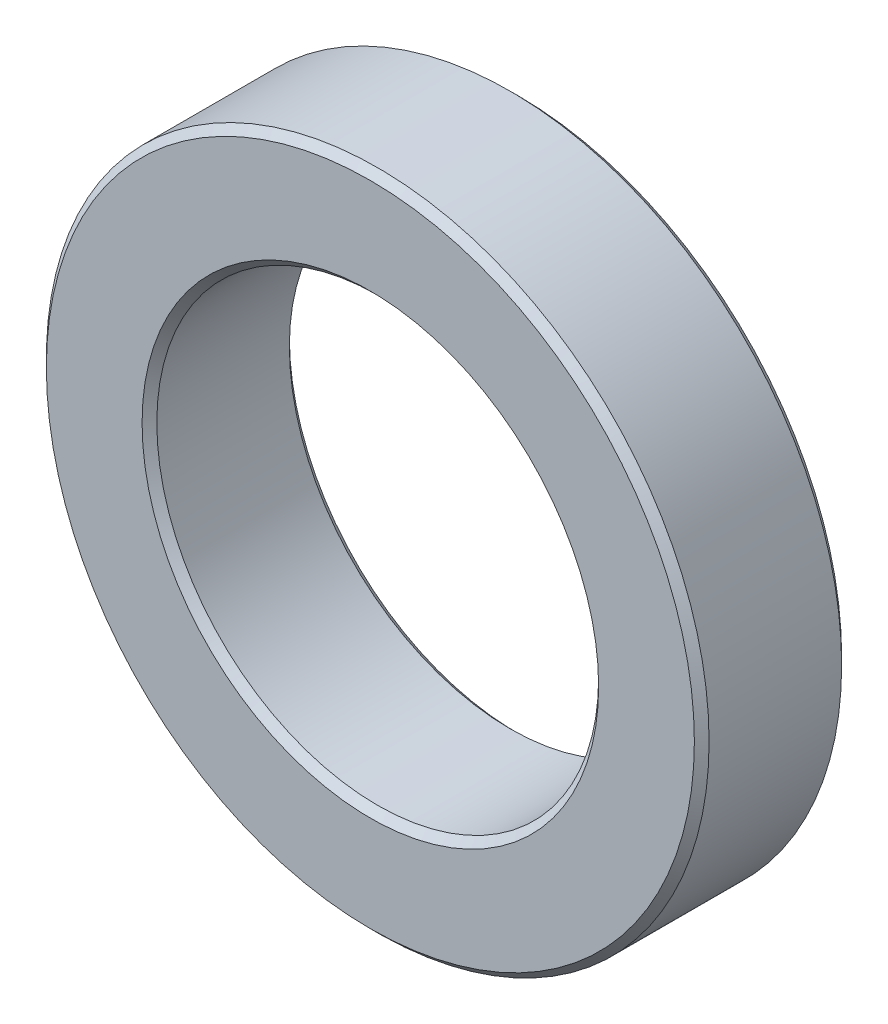
ISO-10303-21;
HEADER;
FILE_DESCRIPTION(('STEP AP214'),'2;1');
FILE_NAME('part.step','',(''),(''),'','','');
FILE_SCHEMA(('AUTOMOTIVE_DESIGN { 1 0 10303 214 1 1 1 1 }'));
ENDSEC;
DATA;
#1=APPLICATION_CONTEXT('core data for automotive mechanical design processes');
#2=APPLICATION_PROTOCOL_DEFINITION('international standard','automotive_design',2000,#1);
#3=PRODUCT_CONTEXT('',#1,'mechanical');
#4=PRODUCT('Part','Part','',(#3));
#5=PRODUCT_RELATED_PRODUCT_CATEGORY('part','',(#4));
#6=PRODUCT_DEFINITION_FORMATION('','',#4);
#7=PRODUCT_DEFINITION_CONTEXT('part definition',#1,'design');
#8=PRODUCT_DEFINITION('design','',#6,#7);
#9=PRODUCT_DEFINITION_SHAPE('','',#8);
#10=(LENGTH_UNIT() NAMED_UNIT(*) SI_UNIT(.MILLI.,.METRE.));
#11=(NAMED_UNIT(*) PLANE_ANGLE_UNIT() SI_UNIT($,.RADIAN.));
#12=(NAMED_UNIT(*) SI_UNIT($,.STERADIAN.) SOLID_ANGLE_UNIT());
#13=UNCERTAINTY_MEASURE_WITH_UNIT(LENGTH_MEASURE(1.E-05),#10,'distance_accuracy_value','');
#14=(GEOMETRIC_REPRESENTATION_CONTEXT(3) GLOBAL_UNCERTAINTY_ASSIGNED_CONTEXT((#13)) GLOBAL_UNIT_ASSIGNED_CONTEXT((#10,
#11,#12)) REPRESENTATION_CONTEXT('',''));
#15=CARTESIAN_POINT('',(0.,0.,0.));
#16=DIRECTION('',(0.,0.,1.));
#17=DIRECTION('',(1.,0.,0.));
#18=AXIS2_PLACEMENT_3D('',#15,#16,#17);
#19=CARTESIAN_POINT('',(0.,0.,1.));
#20=DIRECTION('',(0.,0.,1.));
#21=DIRECTION('',(1.,0.,0.));
#22=AXIS2_PLACEMENT_3D('',#19,#20,#21);
#23=PLANE('',#22);
#24=CARTESIAN_POINT('',(0.,0.,1.));
#25=DIRECTION('',(0.,0.,1.));
#26=DIRECTION('',(1.,0.,0.));
#27=AXIS2_PLACEMENT_3D('',#24,#25,#26);
#28=CIRCLE('',#27,1.55);
#29=CARTESIAN_POINT('',(1.55,0.,1.));
#30=VERTEX_POINT('',#29);
#31=EDGE_CURVE('E53',#30,#30,#28,.F.);
#32=ORIENTED_EDGE('',*,*,#31,.T.);
#33=EDGE_LOOP('',(#32));
#34=FACE_BOUND('',#33,.T.);
#35=CARTESIAN_POINT('',(0.,0.,1.));
#36=DIRECTION('',(0.,0.,1.));
#37=DIRECTION('',(1.,0.,0.));
#38=AXIS2_PLACEMENT_3D('',#35,#36,#37);
#39=CIRCLE('',#38,2.2);
#40=CARTESIAN_POINT('',(2.2,0.,1.));
#41=VERTEX_POINT('',#40);
#42=EDGE_CURVE('E56',#41,#41,#39,.T.);
#43=ORIENTED_EDGE('',*,*,#42,.T.);
#44=EDGE_LOOP('',(#43));
#45=FACE_BOUND('',#44,.T.);
#46=ADVANCED_FACE('F33',(#34,#45),#23,.T.);
#47=CARTESIAN_POINT('',(0.,0.,0.));
#48=DIRECTION('',(0.,0.,1.));
#49=DIRECTION('',(1.,0.,0.));
#50=AXIS2_PLACEMENT_3D('',#47,#48,#49);
#51=PLANE('',#50);
#52=CARTESIAN_POINT('',(0.,0.,0.));
#53=DIRECTION('',(0.,0.,1.));
#54=DIRECTION('',(1.,0.,0.));
#55=AXIS2_PLACEMENT_3D('',#52,#53,#54);
#56=CIRCLE('',#55,1.55);
#57=CARTESIAN_POINT('',(1.55,0.,0.));
#58=VERTEX_POINT('',#57);
#59=EDGE_CURVE('E44',#58,#58,#56,.T.);
#60=ORIENTED_EDGE('',*,*,#59,.T.);
#61=EDGE_LOOP('',(#60));
#62=FACE_BOUND('',#61,.T.);
#63=CARTESIAN_POINT('',(0.,0.,0.));
#64=DIRECTION('',(0.,0.,1.));
#65=DIRECTION('',(1.,0.,0.));
#66=AXIS2_PLACEMENT_3D('',#63,#64,#65);
#67=CIRCLE('',#66,2.2);
#68=CARTESIAN_POINT('',(2.2,0.,0.));
#69=VERTEX_POINT('',#68);
#70=EDGE_CURVE('E48',#69,#69,#67,.F.);
#71=ORIENTED_EDGE('',*,*,#70,.T.);
#72=EDGE_LOOP('',(#71));
#73=FACE_BOUND('',#72,.T.);
#74=ADVANCED_FACE('F76',(#62,#73),#51,.F.);
#75=CARTESIAN_POINT('',(0.,0.,1.));
#76=DIRECTION('',(0.,0.,-1.));
#77=DIRECTION('',(-1.,0.,0.));
#78=AXIS2_PLACEMENT_3D('',#75,#76,#77);
#79=CYLINDRICAL_SURFACE('',#78,2.25);
#80=CARTESIAN_POINT('',(0.,0.,0.0499999999999997));
#81=DIRECTION('',(0.,0.,1.));
#82=DIRECTION('',(1.,0.,0.));
#83=AXIS2_PLACEMENT_3D('',#80,#81,#82);
#84=CIRCLE('',#83,2.25);
#85=CARTESIAN_POINT('',(2.25,0.,0.0499999999999997));
#86=VERTEX_POINT('',#85);
#87=EDGE_CURVE('E10',#86,#86,#84,.T.);
#88=ORIENTED_EDGE('',*,*,#87,.T.);
#89=EDGE_LOOP('',(#88));
#90=FACE_BOUND('',#89,.T.);
#91=CARTESIAN_POINT('',(0.,0.,0.949999999999999));
#92=DIRECTION('',(0.,0.,1.));
#93=DIRECTION('',(1.,0.,0.));
#94=AXIS2_PLACEMENT_3D('',#91,#92,#93);
#95=CIRCLE('',#94,2.25);
#96=CARTESIAN_POINT('',(2.25,0.,0.949999999999999));
#97=VERTEX_POINT('',#96);
#98=EDGE_CURVE('E40',#97,#97,#95,.F.);
#99=ORIENTED_EDGE('',*,*,#98,.T.);
#100=EDGE_LOOP('',(#99));
#101=FACE_BOUND('',#100,.T.);
#102=ADVANCED_FACE('F79',(#90,#101),#79,.T.);
#103=CARTESIAN_POINT('',(0.,0.,1.));
#104=DIRECTION('',(0.,0.,-1.));
#105=DIRECTION('',(-1.,0.,0.));
#106=AXIS2_PLACEMENT_3D('',#103,#104,#105);
#107=CYLINDRICAL_SURFACE('',#106,1.5);
#108=CARTESIAN_POINT('',(0.,0.,0.950000000000001));
#109=DIRECTION('',(0.,0.,1.));
#110=DIRECTION('',(1.,0.,0.));
#111=AXIS2_PLACEMENT_3D('',#108,#109,#110);
#112=CIRCLE('',#111,1.5);
#113=CARTESIAN_POINT('',(1.5,0.,0.950000000000001));
#114=VERTEX_POINT('',#113);
#115=EDGE_CURVE('E59',#114,#114,#112,.T.);
#116=ORIENTED_EDGE('',*,*,#115,.T.);
#117=EDGE_LOOP('',(#116));
#118=FACE_BOUND('',#117,.T.);
#119=CARTESIAN_POINT('',(0.,0.,0.0499999999999993));
#120=DIRECTION('',(0.,0.,1.));
#121=DIRECTION('',(1.,0.,0.));
#122=AXIS2_PLACEMENT_3D('',#119,#120,#121);
#123=CIRCLE('',#122,1.5);
#124=CARTESIAN_POINT('',(1.5,0.,0.0499999999999993));
#125=VERTEX_POINT('',#124);
#126=EDGE_CURVE('E62',#125,#125,#123,.F.);
#127=ORIENTED_EDGE('',*,*,#126,.T.);
#128=EDGE_LOOP('',(#127));
#129=FACE_BOUND('',#128,.T.);
#130=ADVANCED_FACE('F66',(#118,#129),#107,.F.);
#131=CARTESIAN_POINT('',(0.,0.,0.950000000000001));
#132=DIRECTION('',(0.,0.,1.));
#133=DIRECTION('',(1.,0.,0.));
#134=AXIS2_PLACEMENT_3D('',#131,#132,#133);
#135=CONICAL_SURFACE('',#134,1.5,0.785398163397444);
#136=ORIENTED_EDGE('',*,*,#31,.F.);
#137=EDGE_LOOP('',(#136));
#138=FACE_BOUND('',#137,.T.);
#139=ORIENTED_EDGE('',*,*,#115,.F.);
#140=EDGE_LOOP('',(#139));
#141=FACE_BOUND('',#140,.T.);
#142=ADVANCED_FACE('F72',(#138,#141),#135,.F.);
#143=CARTESIAN_POINT('',(0.,0.,0.));
#144=DIRECTION('',(0.,0.,-1.));
#145=DIRECTION('',(-1.,0.,0.));
#146=AXIS2_PLACEMENT_3D('',#143,#144,#145);
#147=CONICAL_SURFACE('',#146,1.55,0.785398163397448);
#148=ORIENTED_EDGE('',*,*,#126,.F.);
#149=EDGE_LOOP('',(#148));
#150=FACE_BOUND('',#149,.T.);
#151=ORIENTED_EDGE('',*,*,#59,.F.);
#152=EDGE_LOOP('',(#151));
#153=FACE_BOUND('',#152,.T.);
#154=ADVANCED_FACE('F68',(#150,#153),#147,.F.);
#155=CARTESIAN_POINT('',(0.,0.,0.0499999999999997));
#156=DIRECTION('',(0.,0.,1.));
#157=DIRECTION('',(1.,0.,0.));
#158=AXIS2_PLACEMENT_3D('',#155,#156,#157);
#159=CONICAL_SURFACE('',#158,2.25,0.785398163397453);
#160=ORIENTED_EDGE('',*,*,#70,.F.);
#161=EDGE_LOOP('',(#160));
#162=FACE_BOUND('',#161,.T.);
#163=ORIENTED_EDGE('',*,*,#87,.F.);
#164=EDGE_LOOP('',(#163));
#165=FACE_BOUND('',#164,.T.);
#166=ADVANCED_FACE('F71',(#162,#165),#159,.T.);
#167=CARTESIAN_POINT('',(0.,0.,1.));
#168=DIRECTION('',(0.,0.,-1.));
#169=DIRECTION('',(-1.,0.,0.));
#170=AXIS2_PLACEMENT_3D('',#167,#168,#169);
#171=CONICAL_SURFACE('',#170,2.2,0.785398163397457);
#172=ORIENTED_EDGE('',*,*,#98,.F.);
#173=EDGE_LOOP('',(#172));
#174=FACE_BOUND('',#173,.T.);
#175=ORIENTED_EDGE('',*,*,#42,.F.);
#176=EDGE_LOOP('',(#175));
#177=FACE_BOUND('',#176,.T.);
#178=ADVANCED_FACE('F35',(#174,#177),#171,.T.);
#179=CLOSED_SHELL('',(#46,#74,#102,#130,#142,#154,#166,#178));
#180=MANIFOLD_SOLID_BREP('B2',#179);
#181=ADVANCED_BREP_SHAPE_REPRESENTATION('',(#18,#180),#14);
#182=SHAPE_DEFINITION_REPRESENTATION(#9,#181);
ENDSEC;
END-ISO-10303-21;
